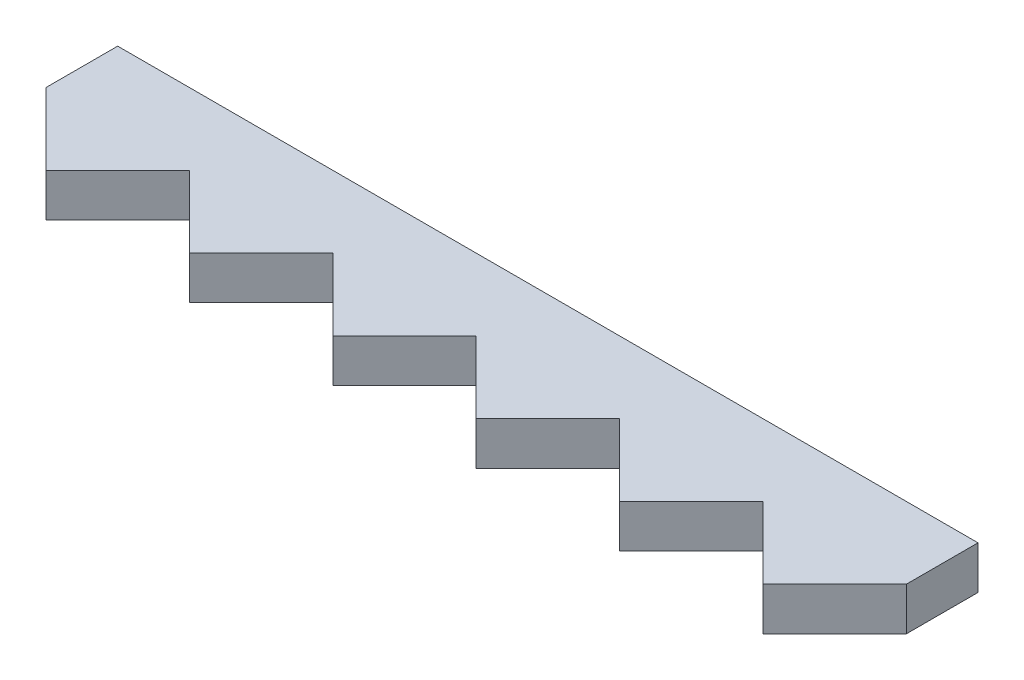
ISO-10303-21;
HEADER;
FILE_DESCRIPTION(('STEP AP214'),'2;1');
FILE_NAME('part.step','',(''),(''),'','','');
FILE_SCHEMA(('AUTOMOTIVE_DESIGN { 1 0 10303 214 1 1 1 1 }'));
ENDSEC;
DATA;
#1=APPLICATION_CONTEXT('core data for automotive mechanical design processes');
#2=APPLICATION_PROTOCOL_DEFINITION('international standard','automotive_design',2000,#1);
#3=PRODUCT_CONTEXT('',#1,'mechanical');
#4=PRODUCT('Part','Part','',(#3));
#5=PRODUCT_RELATED_PRODUCT_CATEGORY('part','',(#4));
#6=PRODUCT_DEFINITION_FORMATION('','',#4);
#7=PRODUCT_DEFINITION_CONTEXT('part definition',#1,'design');
#8=PRODUCT_DEFINITION('design','',#6,#7);
#9=PRODUCT_DEFINITION_SHAPE('','',#8);
#10=(LENGTH_UNIT() NAMED_UNIT(*) SI_UNIT(.MILLI.,.METRE.));
#11=(NAMED_UNIT(*) PLANE_ANGLE_UNIT() SI_UNIT($,.RADIAN.));
#12=(NAMED_UNIT(*) SI_UNIT($,.STERADIAN.) SOLID_ANGLE_UNIT());
#13=UNCERTAINTY_MEASURE_WITH_UNIT(LENGTH_MEASURE(1.E-05),#10,'distance_accuracy_value','');
#14=(GEOMETRIC_REPRESENTATION_CONTEXT(3) GLOBAL_UNCERTAINTY_ASSIGNED_CONTEXT((#13)) GLOBAL_UNIT_ASSIGNED_CONTEXT((#10,
#11,#12)) REPRESENTATION_CONTEXT('',''));
#15=CARTESIAN_POINT('',(0.,0.,0.));
#16=DIRECTION('',(0.,0.,1.));
#17=DIRECTION('',(1.,0.,0.));
#18=AXIS2_PLACEMENT_3D('',#15,#16,#17);
#19=CARTESIAN_POINT('',(0.,6.,-71.6064280380383));
#20=DIRECTION('',(0.,0.,1.));
#21=DIRECTION('',(1.,0.,0.));
#22=AXIS2_PLACEMENT_3D('',#19,#20,#21);
#23=PLANE('',#22);
#24=DIRECTION('',(-1.,0.,0.));
#25=VECTOR('',#24,1.);
#26=CARTESIAN_POINT('',(0.,3.,-71.6064280380383));
#27=LINE('',#26,#25);
#28=CARTESIAN_POINT('',(60.,3.,-71.6064280380383));
#29=VERTEX_POINT('',#28);
#30=CARTESIAN_POINT('',(0.,3.,-71.6064280380383));
#31=VERTEX_POINT('',#30);
#32=EDGE_CURVE('E171',#29,#31,#27,.T.);
#33=ORIENTED_EDGE('',*,*,#32,.T.);
#34=DIRECTION('',(0.,-1.,0.));
#35=VECTOR('',#34,1.);
#36=CARTESIAN_POINT('',(0.,6.,-71.6064280380383));
#37=LINE('',#36,#35);
#38=CARTESIAN_POINT('',(0.,6.,-71.6064280380383));
#39=VERTEX_POINT('',#38);
#40=EDGE_CURVE('E11',#39,#31,#37,.T.);
#41=ORIENTED_EDGE('',*,*,#40,.F.);
#42=DIRECTION('',(-1.,0.,0.));
#43=VECTOR('',#42,1.);
#44=CARTESIAN_POINT('',(0.,6.,-71.6064280380383));
#45=LINE('',#44,#43);
#46=CARTESIAN_POINT('',(60.,6.,-71.6064280380383));
#47=VERTEX_POINT('',#46);
#48=EDGE_CURVE('E199',#47,#39,#45,.T.);
#49=ORIENTED_EDGE('',*,*,#48,.F.);
#50=DIRECTION('',(0.,-1.,0.));
#51=VECTOR('',#50,1.);
#52=CARTESIAN_POINT('',(60.,6.,-71.6064280380383));
#53=LINE('',#52,#51);
#54=EDGE_CURVE('E167',#47,#29,#53,.T.);
#55=ORIENTED_EDGE('',*,*,#54,.T.);
#56=EDGE_LOOP('',(#33,#41,#49,#55));
#57=FACE_BOUND('',#56,.T.);
#58=ADVANCED_FACE('F33',(#57),#23,.F.);
#59=CARTESIAN_POINT('',(0.,6.,-71.6064280380383));
#60=DIRECTION('',(1.,0.,0.));
#61=DIRECTION('',(0.,0.,-1.));
#62=AXIS2_PLACEMENT_3D('',#59,#60,#61);
#63=PLANE('',#62);
#64=DIRECTION('',(0.,0.,1.));
#65=VECTOR('',#64,1.);
#66=CARTESIAN_POINT('',(0.,3.,-71.6064280380383));
#67=LINE('',#66,#65);
#68=CARTESIAN_POINT('',(0.,3.,-66.6064280380382));
#69=VERTEX_POINT('',#68);
#70=EDGE_CURVE('E174',#31,#69,#67,.T.);
#71=ORIENTED_EDGE('',*,*,#70,.T.);
#72=DIRECTION('',(0.,-1.,0.));
#73=VECTOR('',#72,1.);
#74=CARTESIAN_POINT('',(0.,6.,-66.6064280380382));
#75=LINE('',#74,#73);
#76=CARTESIAN_POINT('',(0.,6.,-66.6064280380382));
#77=VERTEX_POINT('',#76);
#78=EDGE_CURVE('E41',#77,#69,#75,.T.);
#79=ORIENTED_EDGE('',*,*,#78,.F.);
#80=DIRECTION('',(0.,0.,1.));
#81=VECTOR('',#80,1.);
#82=CARTESIAN_POINT('',(0.,6.,-71.6064280380383));
#83=LINE('',#82,#81);
#84=EDGE_CURVE('E113',#39,#77,#83,.T.);
#85=ORIENTED_EDGE('',*,*,#84,.F.);
#86=ORIENTED_EDGE('',*,*,#40,.T.);
#87=EDGE_LOOP('',(#71,#79,#85,#86));
#88=FACE_BOUND('',#87,.T.);
#89=ADVANCED_FACE('F292',(#88),#63,.F.);
#90=CARTESIAN_POINT('',(0.,6.,-66.6064280380382));
#91=DIRECTION('',(0.707106781186547,0.,-0.707106781186548));
#92=DIRECTION('',(-0.707106781186548,0.,-0.707106781186547));
#93=AXIS2_PLACEMENT_3D('',#90,#91,#92);
#94=PLANE('',#93);
#95=DIRECTION('',(0.707106781186548,0.,0.707106781186547));
#96=VECTOR('',#95,1.);
#97=CARTESIAN_POINT('',(0.,3.,-66.6064280380382));
#98=LINE('',#97,#96);
#99=CARTESIAN_POINT('',(5.,3.,-61.6064280380383));
#100=VERTEX_POINT('',#99);
#101=EDGE_CURVE('E176',#69,#100,#98,.T.);
#102=ORIENTED_EDGE('',*,*,#101,.T.);
#103=DIRECTION('',(0.,-1.,0.));
#104=VECTOR('',#103,1.);
#105=CARTESIAN_POINT('',(5.,6.,-61.6064280380383));
#106=LINE('',#105,#104);
#107=CARTESIAN_POINT('',(5.,6.,-61.6064280380383));
#108=VERTEX_POINT('',#107);
#109=EDGE_CURVE('E227',#108,#100,#106,.T.);
#110=ORIENTED_EDGE('',*,*,#109,.F.);
#111=DIRECTION('',(0.707106781186548,0.,0.707106781186547));
#112=VECTOR('',#111,1.);
#113=CARTESIAN_POINT('',(0.,6.,-66.6064280380382));
#114=LINE('',#113,#112);
#115=EDGE_CURVE('E235',#77,#108,#114,.T.);
#116=ORIENTED_EDGE('',*,*,#115,.F.);
#117=ORIENTED_EDGE('',*,*,#78,.T.);
#118=EDGE_LOOP('',(#102,#110,#116,#117));
#119=FACE_BOUND('',#118,.T.);
#120=ADVANCED_FACE('F233',(#119),#94,.F.);
#121=CARTESIAN_POINT('',(5.,6.,-61.6064280380383));
#122=DIRECTION('',(-0.707106781186547,0.,-0.707106781186548));
#123=DIRECTION('',(-0.707106781186548,0.,0.707106781186547));
#124=AXIS2_PLACEMENT_3D('',#121,#122,#123);
#125=PLANE('',#124);
#126=DIRECTION('',(0.707106781186548,0.,-0.707106781186547));
#127=VECTOR('',#126,1.);
#128=CARTESIAN_POINT('',(5.,3.,-61.6064280380383));
#129=LINE('',#128,#127);
#130=CARTESIAN_POINT('',(10.,3.,-66.6064280380382));
#131=VERTEX_POINT('',#130);
#132=EDGE_CURVE('E178',#100,#131,#129,.T.);
#133=ORIENTED_EDGE('',*,*,#132,.T.);
#134=DIRECTION('',(0.,-1.,0.));
#135=VECTOR('',#134,1.);
#136=CARTESIAN_POINT('',(10.,6.,-66.6064280380382));
#137=LINE('',#136,#135);
#138=CARTESIAN_POINT('',(10.,6.,-66.6064280380382));
#139=VERTEX_POINT('',#138);
#140=EDGE_CURVE('E224',#139,#131,#137,.T.);
#141=ORIENTED_EDGE('',*,*,#140,.F.);
#142=DIRECTION('',(0.707106781186548,0.,-0.707106781186547));
#143=VECTOR('',#142,1.);
#144=CARTESIAN_POINT('',(5.,6.,-61.6064280380383));
#145=LINE('',#144,#143);
#146=EDGE_CURVE('E253',#108,#139,#145,.T.);
#147=ORIENTED_EDGE('',*,*,#146,.F.);
#148=ORIENTED_EDGE('',*,*,#109,.T.);
#149=EDGE_LOOP('',(#133,#141,#147,#148));
#150=FACE_BOUND('',#149,.T.);
#151=ADVANCED_FACE('F244',(#150),#125,.F.);
#152=CARTESIAN_POINT('',(10.,6.,-66.6064280380382));
#153=DIRECTION('',(0.707106781186548,0.,-0.707106781186548));
#154=DIRECTION('',(-0.707106781186548,0.,-0.707106781186548));
#155=AXIS2_PLACEMENT_3D('',#152,#153,#154);
#156=PLANE('',#155);
#157=DIRECTION('',(0.707106781186547,0.,0.707106781186547));
#158=VECTOR('',#157,1.);
#159=CARTESIAN_POINT('',(10.,3.,-66.6064280380382));
#160=LINE('',#159,#158);
#161=CARTESIAN_POINT('',(15.,3.,-61.6064280380383));
#162=VERTEX_POINT('',#161);
#163=EDGE_CURVE('E180',#131,#162,#160,.T.);
#164=ORIENTED_EDGE('',*,*,#163,.T.);
#165=DIRECTION('',(0.,-1.,0.));
#166=VECTOR('',#165,1.);
#167=CARTESIAN_POINT('',(15.,6.,-61.6064280380383));
#168=LINE('',#167,#166);
#169=CARTESIAN_POINT('',(15.,6.,-61.6064280380383));
#170=VERTEX_POINT('',#169);
#171=EDGE_CURVE('E221',#170,#162,#168,.T.);
#172=ORIENTED_EDGE('',*,*,#171,.F.);
#173=DIRECTION('',(0.707106781186547,0.,0.707106781186547));
#174=VECTOR('',#173,1.);
#175=CARTESIAN_POINT('',(10.,6.,-66.6064280380382));
#176=LINE('',#175,#174);
#177=EDGE_CURVE('E250',#139,#170,#176,.T.);
#178=ORIENTED_EDGE('',*,*,#177,.F.);
#179=ORIENTED_EDGE('',*,*,#140,.T.);
#180=EDGE_LOOP('',(#164,#172,#178,#179));
#181=FACE_BOUND('',#180,.T.);
#182=ADVANCED_FACE('F248',(#181),#156,.F.);
#183=CARTESIAN_POINT('',(15.,6.,-61.6064280380383));
#184=DIRECTION('',(-0.707106781186547,0.,-0.707106781186548));
#185=DIRECTION('',(-0.707106781186548,0.,0.707106781186547));
#186=AXIS2_PLACEMENT_3D('',#183,#184,#185);
#187=PLANE('',#186);
#188=DIRECTION('',(0.707106781186548,0.,-0.707106781186547));
#189=VECTOR('',#188,1.);
#190=CARTESIAN_POINT('',(15.,3.,-61.6064280380383));
#191=LINE('',#190,#189);
#192=CARTESIAN_POINT('',(20.,3.,-66.6064280380382));
#193=VERTEX_POINT('',#192);
#194=EDGE_CURVE('E182',#162,#193,#191,.T.);
#195=ORIENTED_EDGE('',*,*,#194,.T.);
#196=DIRECTION('',(0.,-1.,0.));
#197=VECTOR('',#196,1.);
#198=CARTESIAN_POINT('',(20.,6.,-66.6064280380382));
#199=LINE('',#198,#197);
#200=CARTESIAN_POINT('',(20.,6.,-66.6064280380382));
#201=VERTEX_POINT('',#200);
#202=EDGE_CURVE('E218',#201,#193,#199,.T.);
#203=ORIENTED_EDGE('',*,*,#202,.F.);
#204=DIRECTION('',(0.707106781186548,0.,-0.707106781186547));
#205=VECTOR('',#204,1.);
#206=CARTESIAN_POINT('',(15.,6.,-61.6064280380383));
#207=LINE('',#206,#205);
#208=EDGE_CURVE('E252',#170,#201,#207,.T.);
#209=ORIENTED_EDGE('',*,*,#208,.F.);
#210=ORIENTED_EDGE('',*,*,#171,.T.);
#211=EDGE_LOOP('',(#195,#203,#209,#210));
#212=FACE_BOUND('',#211,.T.);
#213=ADVANCED_FACE('F305',(#212),#187,.F.);
#214=CARTESIAN_POINT('',(20.,6.,-66.6064280380382));
#215=DIRECTION('',(0.707106781186547,0.,-0.707106781186548));
#216=DIRECTION('',(-0.707106781186548,0.,-0.707106781186547));
#217=AXIS2_PLACEMENT_3D('',#214,#215,#216);
#218=PLANE('',#217);
#219=DIRECTION('',(0.707106781186548,0.,0.707106781186547));
#220=VECTOR('',#219,1.);
#221=CARTESIAN_POINT('',(20.,3.,-66.6064280380382));
#222=LINE('',#221,#220);
#223=CARTESIAN_POINT('',(25.,3.,-61.6064280380383));
#224=VERTEX_POINT('',#223);
#225=EDGE_CURVE('E184',#193,#224,#222,.T.);
#226=ORIENTED_EDGE('',*,*,#225,.T.);
#227=DIRECTION('',(0.,-1.,0.));
#228=VECTOR('',#227,1.);
#229=CARTESIAN_POINT('',(25.,6.,-61.6064280380383));
#230=LINE('',#229,#228);
#231=CARTESIAN_POINT('',(25.,6.,-61.6064280380383));
#232=VERTEX_POINT('',#231);
#233=EDGE_CURVE('E215',#232,#224,#230,.T.);
#234=ORIENTED_EDGE('',*,*,#233,.F.);
#235=DIRECTION('',(0.707106781186548,0.,0.707106781186547));
#236=VECTOR('',#235,1.);
#237=CARTESIAN_POINT('',(20.,6.,-66.6064280380382));
#238=LINE('',#237,#236);
#239=EDGE_CURVE('E255',#201,#232,#238,.T.);
#240=ORIENTED_EDGE('',*,*,#239,.F.);
#241=ORIENTED_EDGE('',*,*,#202,.T.);
#242=EDGE_LOOP('',(#226,#234,#240,#241));
#243=FACE_BOUND('',#242,.T.);
#244=ADVANCED_FACE('F308',(#243),#218,.F.);
#245=CARTESIAN_POINT('',(25.,6.,-61.6064280380383));
#246=DIRECTION('',(-0.707106781186547,0.,-0.707106781186548));
#247=DIRECTION('',(-0.707106781186548,0.,0.707106781186547));
#248=AXIS2_PLACEMENT_3D('',#245,#246,#247);
#249=PLANE('',#248);
#250=DIRECTION('',(0.707106781186548,0.,-0.707106781186547));
#251=VECTOR('',#250,1.);
#252=CARTESIAN_POINT('',(25.,3.,-61.6064280380383));
#253=LINE('',#252,#251);
#254=CARTESIAN_POINT('',(30.,3.,-66.6064280380382));
#255=VERTEX_POINT('',#254);
#256=EDGE_CURVE('E186',#224,#255,#253,.T.);
#257=ORIENTED_EDGE('',*,*,#256,.T.);
#258=DIRECTION('',(0.,-1.,0.));
#259=VECTOR('',#258,1.);
#260=CARTESIAN_POINT('',(30.,6.,-66.6064280380382));
#261=LINE('',#260,#259);
#262=CARTESIAN_POINT('',(30.,6.,-66.6064280380382));
#263=VERTEX_POINT('',#262);
#264=EDGE_CURVE('E212',#263,#255,#261,.T.);
#265=ORIENTED_EDGE('',*,*,#264,.F.);
#266=DIRECTION('',(0.707106781186548,0.,-0.707106781186547));
#267=VECTOR('',#266,1.);
#268=CARTESIAN_POINT('',(25.,6.,-61.6064280380383));
#269=LINE('',#268,#267);
#270=EDGE_CURVE('E261',#232,#263,#269,.T.);
#271=ORIENTED_EDGE('',*,*,#270,.F.);
#272=ORIENTED_EDGE('',*,*,#233,.T.);
#273=EDGE_LOOP('',(#257,#265,#271,#272));
#274=FACE_BOUND('',#273,.T.);
#275=ADVANCED_FACE('F312',(#274),#249,.F.);
#276=CARTESIAN_POINT('',(30.,6.,-66.6064280380382));
#277=DIRECTION('',(0.707106781186547,0.,-0.707106781186548));
#278=DIRECTION('',(-0.707106781186548,0.,-0.707106781186547));
#279=AXIS2_PLACEMENT_3D('',#276,#277,#278);
#280=PLANE('',#279);
#281=DIRECTION('',(0.707106781186548,0.,0.707106781186547));
#282=VECTOR('',#281,1.);
#283=CARTESIAN_POINT('',(30.,3.,-66.6064280380382));
#284=LINE('',#283,#282);
#285=CARTESIAN_POINT('',(35.,3.,-61.6064280380383));
#286=VERTEX_POINT('',#285);
#287=EDGE_CURVE('E188',#255,#286,#284,.T.);
#288=ORIENTED_EDGE('',*,*,#287,.T.);
#289=DIRECTION('',(0.,-1.,0.));
#290=VECTOR('',#289,1.);
#291=CARTESIAN_POINT('',(35.,6.,-61.6064280380383));
#292=LINE('',#291,#290);
#293=CARTESIAN_POINT('',(35.,6.,-61.6064280380383));
#294=VERTEX_POINT('',#293);
#295=EDGE_CURVE('E209',#294,#286,#292,.T.);
#296=ORIENTED_EDGE('',*,*,#295,.F.);
#297=DIRECTION('',(0.707106781186548,0.,0.707106781186547));
#298=VECTOR('',#297,1.);
#299=CARTESIAN_POINT('',(30.,6.,-66.6064280380382));
#300=LINE('',#299,#298);
#301=EDGE_CURVE('E263',#263,#294,#300,.T.);
#302=ORIENTED_EDGE('',*,*,#301,.F.);
#303=ORIENTED_EDGE('',*,*,#264,.T.);
#304=EDGE_LOOP('',(#288,#296,#302,#303));
#305=FACE_BOUND('',#304,.T.);
#306=ADVANCED_FACE('F316',(#305),#280,.F.);
#307=CARTESIAN_POINT('',(35.,6.,-61.6064280380383));
#308=DIRECTION('',(-0.707106781186548,0.,-0.707106781186548));
#309=DIRECTION('',(-0.707106781186548,0.,0.707106781186548));
#310=AXIS2_PLACEMENT_3D('',#307,#308,#309);
#311=PLANE('',#310);
#312=DIRECTION('',(0.707106781186547,0.,-0.707106781186547));
#313=VECTOR('',#312,1.);
#314=CARTESIAN_POINT('',(35.,3.,-61.6064280380383));
#315=LINE('',#314,#313);
#316=CARTESIAN_POINT('',(40.,3.,-66.6064280380382));
#317=VERTEX_POINT('',#316);
#318=EDGE_CURVE('E190',#286,#317,#315,.T.);
#319=ORIENTED_EDGE('',*,*,#318,.T.);
#320=DIRECTION('',(0.,-1.,0.));
#321=VECTOR('',#320,1.);
#322=CARTESIAN_POINT('',(40.,6.,-66.6064280380382));
#323=LINE('',#322,#321);
#324=CARTESIAN_POINT('',(40.,6.,-66.6064280380382));
#325=VERTEX_POINT('',#324);
#326=EDGE_CURVE('E206',#325,#317,#323,.T.);
#327=ORIENTED_EDGE('',*,*,#326,.F.);
#328=DIRECTION('',(0.707106781186547,0.,-0.707106781186547));
#329=VECTOR('',#328,1.);
#330=CARTESIAN_POINT('',(35.,6.,-61.6064280380383));
#331=LINE('',#330,#329);
#332=EDGE_CURVE('E265',#294,#325,#331,.T.);
#333=ORIENTED_EDGE('',*,*,#332,.F.);
#334=ORIENTED_EDGE('',*,*,#295,.T.);
#335=EDGE_LOOP('',(#319,#327,#333,#334));
#336=FACE_BOUND('',#335,.T.);
#337=ADVANCED_FACE('F320',(#336),#311,.F.);
#338=CARTESIAN_POINT('',(40.,6.,-66.6064280380382));
#339=DIRECTION('',(0.707106781186547,0.,-0.707106781186548));
#340=DIRECTION('',(-0.707106781186548,0.,-0.707106781186547));
#341=AXIS2_PLACEMENT_3D('',#338,#339,#340);
#342=PLANE('',#341);
#343=DIRECTION('',(0.707106781186548,0.,0.707106781186547));
#344=VECTOR('',#343,1.);
#345=CARTESIAN_POINT('',(40.,3.,-66.6064280380382));
#346=LINE('',#345,#344);
#347=CARTESIAN_POINT('',(45.,3.,-61.6064280380383));
#348=VERTEX_POINT('',#347);
#349=EDGE_CURVE('E192',#317,#348,#346,.T.);
#350=ORIENTED_EDGE('',*,*,#349,.T.);
#351=DIRECTION('',(0.,-1.,0.));
#352=VECTOR('',#351,1.);
#353=CARTESIAN_POINT('',(45.,6.,-61.6064280380383));
#354=LINE('',#353,#352);
#355=CARTESIAN_POINT('',(45.,6.,-61.6064280380383));
#356=VERTEX_POINT('',#355);
#357=EDGE_CURVE('E203',#356,#348,#354,.T.);
#358=ORIENTED_EDGE('',*,*,#357,.F.);
#359=DIRECTION('',(0.707106781186548,0.,0.707106781186547));
#360=VECTOR('',#359,1.);
#361=CARTESIAN_POINT('',(40.,6.,-66.6064280380382));
#362=LINE('',#361,#360);
#363=EDGE_CURVE('E267',#325,#356,#362,.T.);
#364=ORIENTED_EDGE('',*,*,#363,.F.);
#365=ORIENTED_EDGE('',*,*,#326,.T.);
#366=EDGE_LOOP('',(#350,#358,#364,#365));
#367=FACE_BOUND('',#366,.T.);
#368=ADVANCED_FACE('F273',(#367),#342,.F.);
#369=CARTESIAN_POINT('',(45.,6.,-61.6064280380383));
#370=DIRECTION('',(-0.707106781186547,0.,-0.707106781186548));
#371=DIRECTION('',(-0.707106781186548,0.,0.707106781186547));
#372=AXIS2_PLACEMENT_3D('',#369,#370,#371);
#373=PLANE('',#372);
#374=DIRECTION('',(0.707106781186548,0.,-0.707106781186547));
#375=VECTOR('',#374,1.);
#376=CARTESIAN_POINT('',(45.,3.,-61.6064280380383));
#377=LINE('',#376,#375);
#378=CARTESIAN_POINT('',(50.,3.,-66.6064280380382));
#379=VERTEX_POINT('',#378);
#380=EDGE_CURVE('E194',#348,#379,#377,.T.);
#381=ORIENTED_EDGE('',*,*,#380,.T.);
#382=DIRECTION('',(0.,-1.,0.));
#383=VECTOR('',#382,1.);
#384=CARTESIAN_POINT('',(50.,6.,-66.6064280380382));
#385=LINE('',#384,#383);
#386=CARTESIAN_POINT('',(50.,6.,-66.6064280380382));
#387=VERTEX_POINT('',#386);
#388=EDGE_CURVE('E162',#387,#379,#385,.T.);
#389=ORIENTED_EDGE('',*,*,#388,.F.);
#390=DIRECTION('',(0.707106781186548,0.,-0.707106781186547));
#391=VECTOR('',#390,1.);
#392=CARTESIAN_POINT('',(45.,6.,-61.6064280380383));
#393=LINE('',#392,#391);
#394=EDGE_CURVE('E153',#356,#387,#393,.T.);
#395=ORIENTED_EDGE('',*,*,#394,.F.);
#396=ORIENTED_EDGE('',*,*,#357,.T.);
#397=EDGE_LOOP('',(#381,#389,#395,#396));
#398=FACE_BOUND('',#397,.T.);
#399=ADVANCED_FACE('F277',(#398),#373,.F.);
#400=CARTESIAN_POINT('',(50.,6.,-66.6064280380382));
#401=DIRECTION('',(0.707106781186547,0.,-0.707106781186548));
#402=DIRECTION('',(-0.707106781186548,0.,-0.707106781186547));
#403=AXIS2_PLACEMENT_3D('',#400,#401,#402);
#404=PLANE('',#403);
#405=DIRECTION('',(0.707106781186548,0.,0.707106781186547));
#406=VECTOR('',#405,1.);
#407=CARTESIAN_POINT('',(50.,3.,-66.6064280380382));
#408=LINE('',#407,#406);
#409=CARTESIAN_POINT('',(55.,3.,-61.6064280380383));
#410=VERTEX_POINT('',#409);
#411=EDGE_CURVE('E161',#379,#410,#408,.T.);
#412=ORIENTED_EDGE('',*,*,#411,.T.);
#413=DIRECTION('',(0.,-1.,0.));
#414=VECTOR('',#413,1.);
#415=CARTESIAN_POINT('',(55.,6.,-61.6064280380383));
#416=LINE('',#415,#414);
#417=CARTESIAN_POINT('',(55.,6.,-61.6064280380383));
#418=VERTEX_POINT('',#417);
#419=EDGE_CURVE('E158',#418,#410,#416,.T.);
#420=ORIENTED_EDGE('',*,*,#419,.F.);
#421=DIRECTION('',(0.707106781186548,0.,0.707106781186547));
#422=VECTOR('',#421,1.);
#423=CARTESIAN_POINT('',(50.,6.,-66.6064280380382));
#424=LINE('',#423,#422);
#425=EDGE_CURVE('E147',#387,#418,#424,.T.);
#426=ORIENTED_EDGE('',*,*,#425,.F.);
#427=ORIENTED_EDGE('',*,*,#388,.T.);
#428=EDGE_LOOP('',(#412,#420,#426,#427));
#429=FACE_BOUND('',#428,.T.);
#430=ADVANCED_FACE('F159',(#429),#404,.F.);
#431=CARTESIAN_POINT('',(55.,6.,-61.6064280380383));
#432=DIRECTION('',(-0.707106781186547,0.,-0.707106781186549));
#433=DIRECTION('',(-0.707106781186549,0.,0.707106781186547));
#434=AXIS2_PLACEMENT_3D('',#431,#432,#433);
#435=PLANE('',#434);
#436=DIRECTION('',(0.707106781186548,0.,-0.707106781186546));
#437=VECTOR('',#436,1.);
#438=CARTESIAN_POINT('',(55.,3.,-61.6064280380383));
#439=LINE('',#438,#437);
#440=CARTESIAN_POINT('',(60.,3.,-66.6064280380382));
#441=VERTEX_POINT('',#440);
#442=EDGE_CURVE('E99',#410,#441,#439,.T.);
#443=ORIENTED_EDGE('',*,*,#442,.T.);
#444=DIRECTION('',(0.,-1.,0.));
#445=VECTOR('',#444,1.);
#446=CARTESIAN_POINT('',(60.,6.,-66.6064280380382));
#447=LINE('',#446,#445);
#448=CARTESIAN_POINT('',(60.,6.,-66.6064280380382));
#449=VERTEX_POINT('',#448);
#450=EDGE_CURVE('E163',#449,#441,#447,.T.);
#451=ORIENTED_EDGE('',*,*,#450,.F.);
#452=DIRECTION('',(0.707106781186548,0.,-0.707106781186546));
#453=VECTOR('',#452,1.);
#454=CARTESIAN_POINT('',(55.,6.,-61.6064280380383));
#455=LINE('',#454,#453);
#456=EDGE_CURVE('E151',#418,#449,#455,.T.);
#457=ORIENTED_EDGE('',*,*,#456,.F.);
#458=ORIENTED_EDGE('',*,*,#419,.T.);
#459=EDGE_LOOP('',(#443,#451,#457,#458));
#460=FACE_BOUND('',#459,.T.);
#461=ADVANCED_FACE('F165',(#460),#435,.F.);
#462=CARTESIAN_POINT('',(60.,6.,-66.6064280380382));
#463=DIRECTION('',(-1.,0.,0.));
#464=DIRECTION('',(0.,0.,1.));
#465=AXIS2_PLACEMENT_3D('',#462,#463,#464);
#466=PLANE('',#465);
#467=DIRECTION('',(0.,0.,-1.));
#468=VECTOR('',#467,1.);
#469=CARTESIAN_POINT('',(60.,3.,-66.6064280380382));
#470=LINE('',#469,#468);
#471=EDGE_CURVE('E105',#441,#29,#470,.T.);
#472=ORIENTED_EDGE('',*,*,#471,.T.);
#473=ORIENTED_EDGE('',*,*,#54,.F.);
#474=DIRECTION('',(0.,0.,-1.));
#475=VECTOR('',#474,1.);
#476=CARTESIAN_POINT('',(60.,6.,-66.6064280380382));
#477=LINE('',#476,#475);
#478=EDGE_CURVE('E49',#449,#47,#477,.T.);
#479=ORIENTED_EDGE('',*,*,#478,.F.);
#480=ORIENTED_EDGE('',*,*,#450,.T.);
#481=EDGE_LOOP('',(#472,#473,#479,#480));
#482=FACE_BOUND('',#481,.T.);
#483=ADVANCED_FACE('F281',(#482),#466,.F.);
#484=CARTESIAN_POINT('',(0.,6.,0.));
#485=DIRECTION('',(0.,1.,0.));
#486=DIRECTION('',(0.,0.,1.));
#487=AXIS2_PLACEMENT_3D('',#484,#485,#486);
#488=PLANE('',#487);
#489=ORIENTED_EDGE('',*,*,#48,.T.);
#490=ORIENTED_EDGE('',*,*,#84,.T.);
#491=ORIENTED_EDGE('',*,*,#115,.T.);
#492=ORIENTED_EDGE('',*,*,#146,.T.);
#493=ORIENTED_EDGE('',*,*,#177,.T.);
#494=ORIENTED_EDGE('',*,*,#208,.T.);
#495=ORIENTED_EDGE('',*,*,#239,.T.);
#496=ORIENTED_EDGE('',*,*,#270,.T.);
#497=ORIENTED_EDGE('',*,*,#301,.T.);
#498=ORIENTED_EDGE('',*,*,#332,.T.);
#499=ORIENTED_EDGE('',*,*,#363,.T.);
#500=ORIENTED_EDGE('',*,*,#394,.T.);
#501=ORIENTED_EDGE('',*,*,#425,.T.);
#502=ORIENTED_EDGE('',*,*,#456,.T.);
#503=ORIENTED_EDGE('',*,*,#478,.T.);
#504=EDGE_LOOP('',(#489,#490,#491,#492,#493,#494,#495,#496,#497,#498,#499,#500,#501,#502,#503));
#505=FACE_BOUND('',#504,.T.);
#506=ADVANCED_FACE('F149',(#505),#488,.T.);
#507=CARTESIAN_POINT('',(0.,3.,0.));
#508=DIRECTION('',(0.,1.,0.));
#509=DIRECTION('',(0.,0.,1.));
#510=AXIS2_PLACEMENT_3D('',#507,#508,#509);
#511=PLANE('',#510);
#512=ORIENTED_EDGE('',*,*,#32,.F.);
#513=ORIENTED_EDGE('',*,*,#471,.F.);
#514=ORIENTED_EDGE('',*,*,#442,.F.);
#515=ORIENTED_EDGE('',*,*,#411,.F.);
#516=ORIENTED_EDGE('',*,*,#380,.F.);
#517=ORIENTED_EDGE('',*,*,#349,.F.);
#518=ORIENTED_EDGE('',*,*,#318,.F.);
#519=ORIENTED_EDGE('',*,*,#287,.F.);
#520=ORIENTED_EDGE('',*,*,#256,.F.);
#521=ORIENTED_EDGE('',*,*,#225,.F.);
#522=ORIENTED_EDGE('',*,*,#194,.F.);
#523=ORIENTED_EDGE('',*,*,#163,.F.);
#524=ORIENTED_EDGE('',*,*,#132,.F.);
#525=ORIENTED_EDGE('',*,*,#101,.F.);
#526=ORIENTED_EDGE('',*,*,#70,.F.);
#527=EDGE_LOOP('',(#512,#513,#514,#515,#516,#517,#518,#519,#520,#521,#522,#523,#524,#525,#526));
#528=FACE_BOUND('',#527,.T.);
#529=ADVANCED_FACE('F239',(#528),#511,.F.);
#530=CLOSED_SHELL('',(#58,#89,#120,#151,#182,#213,#244,#275,#306,#337,#368,#399,#430,#461,#483,
#506,#529));
#531=MANIFOLD_SOLID_BREP('B2',#530);
#532=ADVANCED_BREP_SHAPE_REPRESENTATION('',(#18,#531),#14);
#533=SHAPE_DEFINITION_REPRESENTATION(#9,#532);
ENDSEC;
END-ISO-10303-21;
